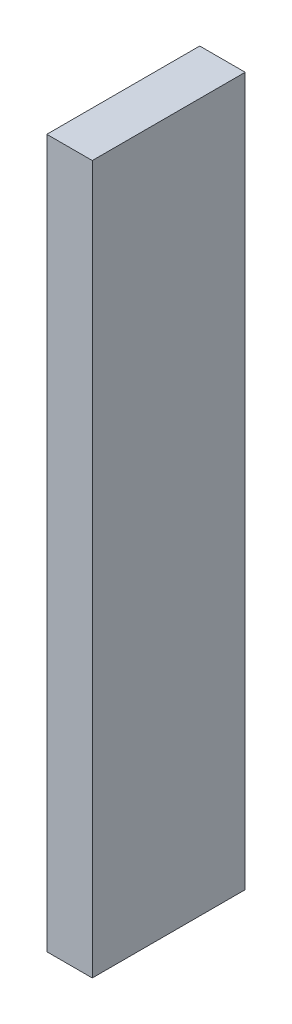
ISO-10303-21;
HEADER;
FILE_DESCRIPTION(('STEP AP214'),'2;1');
FILE_NAME('part.step','',(''),(''),'','','');
FILE_SCHEMA(('AUTOMOTIVE_DESIGN { 1 0 10303 214 1 1 1 1 }'));
ENDSEC;
DATA;
#1=APPLICATION_CONTEXT('core data for automotive mechanical design processes');
#2=APPLICATION_PROTOCOL_DEFINITION('international standard','automotive_design',2000,#1);
#3=PRODUCT_CONTEXT('',#1,'mechanical');
#4=PRODUCT('Part','Part','',(#3));
#5=PRODUCT_RELATED_PRODUCT_CATEGORY('part','',(#4));
#6=PRODUCT_DEFINITION_FORMATION('','',#4);
#7=PRODUCT_DEFINITION_CONTEXT('part definition',#1,'design');
#8=PRODUCT_DEFINITION('design','',#6,#7);
#9=PRODUCT_DEFINITION_SHAPE('','',#8);
#10=(LENGTH_UNIT() NAMED_UNIT(*) SI_UNIT(.MILLI.,.METRE.));
#11=(NAMED_UNIT(*) PLANE_ANGLE_UNIT() SI_UNIT($,.RADIAN.));
#12=(NAMED_UNIT(*) SI_UNIT($,.STERADIAN.) SOLID_ANGLE_UNIT());
#13=UNCERTAINTY_MEASURE_WITH_UNIT(LENGTH_MEASURE(1.E-05),#10,'distance_accuracy_value','');
#14=(GEOMETRIC_REPRESENTATION_CONTEXT(3) GLOBAL_UNCERTAINTY_ASSIGNED_CONTEXT((#13)) GLOBAL_UNIT_ASSIGNED_CONTEXT((#10,
#11,#12)) REPRESENTATION_CONTEXT('',''));
#15=CARTESIAN_POINT('',(0.,0.,0.));
#16=DIRECTION('',(0.,0.,1.));
#17=DIRECTION('',(1.,0.,0.));
#18=AXIS2_PLACEMENT_3D('',#15,#16,#17);
#19=CARTESIAN_POINT('',(130.275545170168,22.4180708263693,111.072024477607));
#20=DIRECTION('',(-1.69244514382854E-09,0.,1.));
#21=DIRECTION('',(1.,0.,1.69244514382854E-09));
#22=AXIS2_PLACEMENT_3D('',#19,#20,#21);
#23=PLANE('',#22);
#24=DIRECTION('',(0.,-1.,0.));
#25=VECTOR('',#24,1.);
#26=CARTESIAN_POINT('',(131.258630267181,22.4180708263693,111.072024479271));
#27=LINE('',#26,#25);
#28=CARTESIAN_POINT('',(131.258630267181,22.4180708263693,111.072024479271));
#29=VERTEX_POINT('',#28);
#30=CARTESIAN_POINT('',(131.258630267181,7.11212965552235,111.072024479271));
#31=VERTEX_POINT('',#30);
#32=EDGE_CURVE('E79',#29,#31,#27,.T.);
#33=ORIENTED_EDGE('',*,*,#32,.F.);
#34=DIRECTION('',(1.,0.,1.69244514382854E-09));
#35=VECTOR('',#34,1.);
#36=CARTESIAN_POINT('',(130.275545170168,22.4180708263693,111.072024477607));
#37=LINE('',#36,#35);
#38=CARTESIAN_POINT('',(130.275545170168,22.4180708263693,111.072024477607));
#39=VERTEX_POINT('',#38);
#40=EDGE_CURVE('E32',#39,#29,#37,.T.);
#41=ORIENTED_EDGE('',*,*,#40,.F.);
#42=DIRECTION('',(0.,-1.,0.));
#43=VECTOR('',#42,1.);
#44=CARTESIAN_POINT('',(130.275545170168,22.4180708263693,111.072024477607));
#45=LINE('',#44,#43);
#46=CARTESIAN_POINT('',(130.275545170168,7.11212965552235,111.072024477607));
#47=VERTEX_POINT('',#46);
#48=EDGE_CURVE('E71',#39,#47,#45,.T.);
#49=ORIENTED_EDGE('',*,*,#48,.T.);
#50=DIRECTION('',(1.,0.,1.69244514382854E-09));
#51=VECTOR('',#50,1.);
#52=CARTESIAN_POINT('',(130.275545170168,7.11212965552235,111.072024477607));
#53=LINE('',#52,#51);
#54=EDGE_CURVE('E10',#47,#31,#53,.T.);
#55=ORIENTED_EDGE('',*,*,#54,.T.);
#56=EDGE_LOOP('',(#33,#41,#49,#55));
#57=FACE_BOUND('',#56,.T.);
#58=ADVANCED_FACE('F16',(#57),#23,.T.);
#59=CARTESIAN_POINT('',(130.275545170168,7.11212965552235,111.072024477607));
#60=DIRECTION('',(0.,-1.,0.));
#61=DIRECTION('',(0.,0.,-1.));
#62=AXIS2_PLACEMENT_3D('',#59,#60,#61);
#63=PLANE('',#62);
#64=DIRECTION('',(1.69244514382854E-09,0.,-1.));
#65=VECTOR('',#64,1.);
#66=CARTESIAN_POINT('',(131.258630267181,7.11212965552235,111.072024479271));
#67=LINE('',#66,#65);
#68=CARTESIAN_POINT('',(131.258630272776,7.11212965552235,107.766083308422));
#69=VERTEX_POINT('',#68);
#70=EDGE_CURVE('E82',#31,#69,#67,.T.);
#71=ORIENTED_EDGE('',*,*,#70,.F.);
#72=ORIENTED_EDGE('',*,*,#54,.F.);
#73=DIRECTION('',(1.69244514382854E-09,0.,-1.));
#74=VECTOR('',#73,1.);
#75=CARTESIAN_POINT('',(130.275545170168,7.11212965552235,111.072024477607));
#76=LINE('',#75,#74);
#77=CARTESIAN_POINT('',(130.275545175763,7.11212965552235,107.766083306758));
#78=VERTEX_POINT('',#77);
#79=EDGE_CURVE('E67',#47,#78,#76,.T.);
#80=ORIENTED_EDGE('',*,*,#79,.T.);
#81=DIRECTION('',(1.,0.,1.69244514382854E-09));
#82=VECTOR('',#81,1.);
#83=CARTESIAN_POINT('',(130.275545175763,7.11212965552235,107.766083306758));
#84=LINE('',#83,#82);
#85=EDGE_CURVE('E24',#78,#69,#84,.T.);
#86=ORIENTED_EDGE('',*,*,#85,.T.);
#87=EDGE_LOOP('',(#71,#72,#80,#86));
#88=FACE_BOUND('',#87,.T.);
#89=ADVANCED_FACE('F68',(#88),#63,.T.);
#90=CARTESIAN_POINT('',(130.275545175763,7.11212965552235,107.766083306758));
#91=DIRECTION('',(1.69244514382854E-09,0.,-1.));
#92=DIRECTION('',(-1.,0.,-1.69244514382854E-09));
#93=AXIS2_PLACEMENT_3D('',#90,#91,#92);
#94=PLANE('',#93);
#95=DIRECTION('',(0.,1.,0.));
#96=VECTOR('',#95,1.);
#97=CARTESIAN_POINT('',(131.258630272776,7.11212965552235,107.766083308422));
#98=LINE('',#97,#96);
#99=CARTESIAN_POINT('',(131.258630272776,22.418070826371,107.766083299961));
#100=VERTEX_POINT('',#99);
#101=EDGE_CURVE('E65',#69,#100,#98,.T.);
#102=ORIENTED_EDGE('',*,*,#101,.F.);
#103=ORIENTED_EDGE('',*,*,#85,.F.);
#104=DIRECTION('',(0.,1.,0.));
#105=VECTOR('',#104,1.);
#106=CARTESIAN_POINT('',(130.275545175763,7.11212965552235,107.766083306758));
#107=LINE('',#106,#105);
#108=CARTESIAN_POINT('',(130.275545175763,22.418070826371,107.766083298297));
#109=VERTEX_POINT('',#108);
#110=EDGE_CURVE('E62',#78,#109,#107,.T.);
#111=ORIENTED_EDGE('',*,*,#110,.T.);
#112=DIRECTION('',(1.,0.,1.69244514382854E-09));
#113=VECTOR('',#112,1.);
#114=CARTESIAN_POINT('',(130.275545175763,22.418070826371,107.766083298297));
#115=LINE('',#114,#113);
#116=EDGE_CURVE('E48',#109,#100,#115,.T.);
#117=ORIENTED_EDGE('',*,*,#116,.T.);
#118=EDGE_LOOP('',(#102,#103,#111,#117));
#119=FACE_BOUND('',#118,.T.);
#120=ADVANCED_FACE('F60',(#119),#94,.T.);
#121=CARTESIAN_POINT('',(130.275545175763,22.418070826371,107.766083298297));
#122=DIRECTION('',(0.,1.,0.));
#123=DIRECTION('',(-1.,0.,0.));
#124=AXIS2_PLACEMENT_3D('',#121,#122,#123);
#125=PLANE('',#124);
#126=DIRECTION('',(-1.69244514382854E-09,0.,1.));
#127=VECTOR('',#126,1.);
#128=CARTESIAN_POINT('',(131.258630272776,22.418070826371,107.766083299961));
#129=LINE('',#128,#127);
#130=EDGE_CURVE('E85',#100,#29,#129,.T.);
#131=ORIENTED_EDGE('',*,*,#130,.F.);
#132=ORIENTED_EDGE('',*,*,#116,.F.);
#133=DIRECTION('',(-1.69244514382854E-09,0.,1.));
#134=VECTOR('',#133,1.);
#135=CARTESIAN_POINT('',(130.275545175763,22.418070826371,107.766083298297));
#136=LINE('',#135,#134);
#137=EDGE_CURVE('E74',#109,#39,#136,.T.);
#138=ORIENTED_EDGE('',*,*,#137,.T.);
#139=ORIENTED_EDGE('',*,*,#40,.T.);
#140=EDGE_LOOP('',(#131,#132,#138,#139));
#141=FACE_BOUND('',#140,.T.);
#142=ADVANCED_FACE('F96',(#141),#125,.T.);
#143=CARTESIAN_POINT('',(130.275545201028,17.2651002409467,92.8378607087388));
#144=DIRECTION('',(1.,0.,1.69244514382854E-09));
#145=DIRECTION('',(0.,1.,0.));
#146=AXIS2_PLACEMENT_3D('',#143,#144,#145);
#147=PLANE('',#146);
#148=ORIENTED_EDGE('',*,*,#48,.F.);
#149=ORIENTED_EDGE('',*,*,#137,.F.);
#150=ORIENTED_EDGE('',*,*,#110,.F.);
#151=ORIENTED_EDGE('',*,*,#79,.F.);
#152=EDGE_LOOP('',(#148,#149,#150,#151));
#153=FACE_BOUND('',#152,.T.);
#154=ADVANCED_FACE('F73',(#153),#147,.F.);
#155=CARTESIAN_POINT('',(131.258630298041,17.2651002409467,92.8378607104026));
#156=DIRECTION('',(1.,0.,1.69244514382854E-09));
#157=DIRECTION('',(0.,1.,0.));
#158=AXIS2_PLACEMENT_3D('',#155,#156,#157);
#159=PLANE('',#158);
#160=ORIENTED_EDGE('',*,*,#32,.T.);
#161=ORIENTED_EDGE('',*,*,#70,.T.);
#162=ORIENTED_EDGE('',*,*,#101,.T.);
#163=ORIENTED_EDGE('',*,*,#130,.T.);
#164=EDGE_LOOP('',(#160,#161,#162,#163));
#165=FACE_BOUND('',#164,.T.);
#166=ADVANCED_FACE('F89',(#165),#159,.T.);
#167=CLOSED_SHELL('',(#58,#89,#120,#142,#154,#166));
#168=MANIFOLD_SOLID_BREP('B1',#167);
#169=ADVANCED_BREP_SHAPE_REPRESENTATION('',(#18,#168),#14);
#170=SHAPE_DEFINITION_REPRESENTATION(#9,#169);
ENDSEC;
END-ISO-10303-21;
